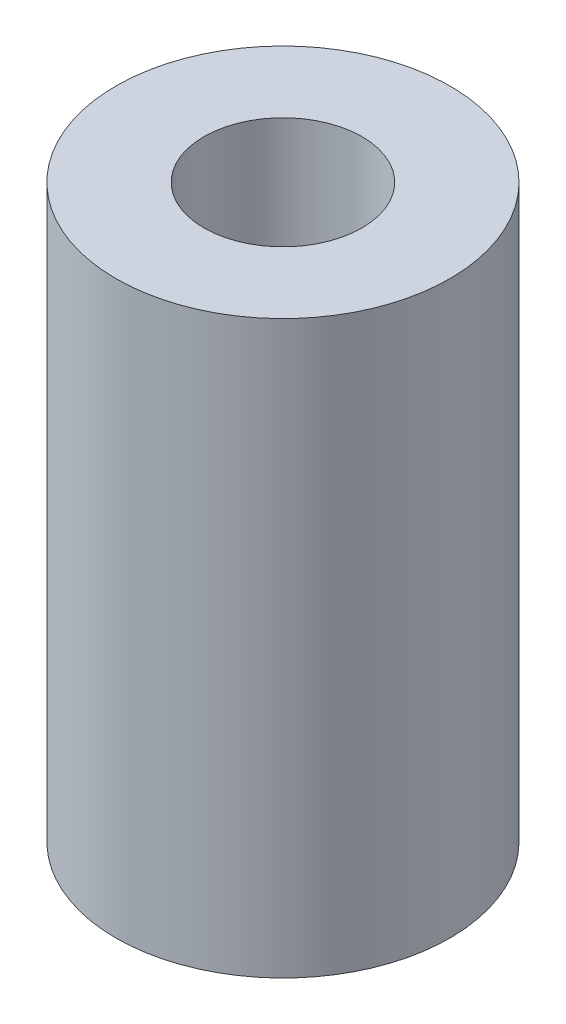
ISO-10303-21;
HEADER;
FILE_DESCRIPTION(('STEP AP214'),'2;1');
FILE_NAME('part.step','',(''),(''),'','','');
FILE_SCHEMA(('AUTOMOTIVE_DESIGN { 1 0 10303 214 1 1 1 1 }'));
ENDSEC;
DATA;
#1=APPLICATION_CONTEXT('core data for automotive mechanical design processes');
#2=APPLICATION_PROTOCOL_DEFINITION('international standard','automotive_design',2000,#1);
#3=PRODUCT_CONTEXT('',#1,'mechanical');
#4=PRODUCT('Part','Part','',(#3));
#5=PRODUCT_RELATED_PRODUCT_CATEGORY('part','',(#4));
#6=PRODUCT_DEFINITION_FORMATION('','',#4);
#7=PRODUCT_DEFINITION_CONTEXT('part definition',#1,'design');
#8=PRODUCT_DEFINITION('design','',#6,#7);
#9=PRODUCT_DEFINITION_SHAPE('','',#8);
#10=(LENGTH_UNIT() NAMED_UNIT(*) SI_UNIT(.MILLI.,.METRE.));
#11=(NAMED_UNIT(*) PLANE_ANGLE_UNIT() SI_UNIT($,.RADIAN.));
#12=(NAMED_UNIT(*) SI_UNIT($,.STERADIAN.) SOLID_ANGLE_UNIT());
#13=UNCERTAINTY_MEASURE_WITH_UNIT(LENGTH_MEASURE(1.E-05),#10,'distance_accuracy_value','');
#14=(GEOMETRIC_REPRESENTATION_CONTEXT(3) GLOBAL_UNCERTAINTY_ASSIGNED_CONTEXT((#13)) GLOBAL_UNIT_ASSIGNED_CONTEXT((#10,
#11,#12)) REPRESENTATION_CONTEXT('',''));
#15=CARTESIAN_POINT('',(0.,0.,0.));
#16=DIRECTION('',(0.,0.,1.));
#17=DIRECTION('',(1.,0.,0.));
#18=AXIS2_PLACEMENT_3D('',#15,#16,#17);
#19=CARTESIAN_POINT('',(0.,13.,0.));
#20=DIRECTION('',(0.,1.,0.));
#21=DIRECTION('',(0.,0.,1.));
#22=AXIS2_PLACEMENT_3D('',#19,#20,#21);
#23=PLANE('',#22);
#24=CARTESIAN_POINT('',(0.,13.,0.));
#25=DIRECTION('',(0.,1.,0.));
#26=DIRECTION('',(0.,0.,1.));
#27=AXIS2_PLACEMENT_3D('',#24,#25,#26);
#28=CIRCLE('',#27,3.8);
#29=CARTESIAN_POINT('',(0.,13.,3.8));
#30=VERTEX_POINT('',#29);
#31=EDGE_CURVE('E10',#30,#30,#28,.T.);
#32=ORIENTED_EDGE('',*,*,#31,.T.);
#33=EDGE_LOOP('',(#32));
#34=FACE_BOUND('',#33,.T.);
#35=CARTESIAN_POINT('',(0.,13.,0.));
#36=DIRECTION('',(0.,1.,0.));
#37=DIRECTION('',(0.,0.,1.));
#38=AXIS2_PLACEMENT_3D('',#35,#36,#37);
#39=CIRCLE('',#38,1.8);
#40=CARTESIAN_POINT('',(0.,13.,1.8));
#41=VERTEX_POINT('',#40);
#42=EDGE_CURVE('E54',#41,#41,#39,.T.);
#43=ORIENTED_EDGE('',*,*,#42,.F.);
#44=EDGE_LOOP('',(#43));
#45=FACE_BOUND('',#44,.T.);
#46=ADVANCED_FACE('F41',(#34,#45),#23,.T.);
#47=CARTESIAN_POINT('',(0.,0.,0.));
#48=DIRECTION('',(0.,1.,0.));
#49=DIRECTION('',(0.,0.,1.));
#50=AXIS2_PLACEMENT_3D('',#47,#48,#49);
#51=PLANE('',#50);
#52=CARTESIAN_POINT('',(0.,0.,0.));
#53=DIRECTION('',(0.,1.,0.));
#54=DIRECTION('',(0.,0.,1.));
#55=AXIS2_PLACEMENT_3D('',#52,#53,#54);
#56=CIRCLE('',#55,3.8);
#57=CARTESIAN_POINT('',(0.,0.,3.8));
#58=VERTEX_POINT('',#57);
#59=EDGE_CURVE('E45',#58,#58,#56,.T.);
#60=ORIENTED_EDGE('',*,*,#59,.F.);
#61=EDGE_LOOP('',(#60));
#62=FACE_BOUND('',#61,.T.);
#63=CARTESIAN_POINT('',(0.,0.,0.));
#64=DIRECTION('',(0.,1.,0.));
#65=DIRECTION('',(0.,0.,1.));
#66=AXIS2_PLACEMENT_3D('',#63,#64,#65);
#67=CIRCLE('',#66,1.8);
#68=CARTESIAN_POINT('',(0.,0.,1.8));
#69=VERTEX_POINT('',#68);
#70=EDGE_CURVE('E56',#69,#69,#67,.T.);
#71=ORIENTED_EDGE('',*,*,#70,.T.);
#72=EDGE_LOOP('',(#71));
#73=FACE_BOUND('',#72,.T.);
#74=ADVANCED_FACE('F68',(#62,#73),#51,.F.);
#75=CARTESIAN_POINT('',(0.,13.,0.));
#76=DIRECTION('',(0.,-1.,0.));
#77=DIRECTION('',(0.,0.,-1.));
#78=AXIS2_PLACEMENT_3D('',#75,#76,#77);
#79=CYLINDRICAL_SURFACE('',#78,3.8);
#80=ORIENTED_EDGE('',*,*,#31,.F.);
#81=EDGE_LOOP('',(#80));
#82=FACE_BOUND('',#81,.T.);
#83=ORIENTED_EDGE('',*,*,#59,.T.);
#84=EDGE_LOOP('',(#83));
#85=FACE_BOUND('',#84,.T.);
#86=ADVANCED_FACE('F43',(#82,#85),#79,.T.);
#87=CARTESIAN_POINT('',(0.,13.,0.));
#88=DIRECTION('',(0.,-1.,0.));
#89=DIRECTION('',(0.,0.,-1.));
#90=AXIS2_PLACEMENT_3D('',#87,#88,#89);
#91=CYLINDRICAL_SURFACE('',#90,1.8);
#92=ORIENTED_EDGE('',*,*,#42,.T.);
#93=EDGE_LOOP('',(#92));
#94=FACE_BOUND('',#93,.T.);
#95=ORIENTED_EDGE('',*,*,#70,.F.);
#96=EDGE_LOOP('',(#95));
#97=FACE_BOUND('',#96,.T.);
#98=ADVANCED_FACE('F64',(#94,#97),#91,.F.);
#99=CLOSED_SHELL('',(#46,#74,#86,#98));
#100=MANIFOLD_SOLID_BREP('B2',#99);
#101=ADVANCED_BREP_SHAPE_REPRESENTATION('',(#18,#100),#14);
#102=SHAPE_DEFINITION_REPRESENTATION(#9,#101);
ENDSEC;
END-ISO-10303-21;
